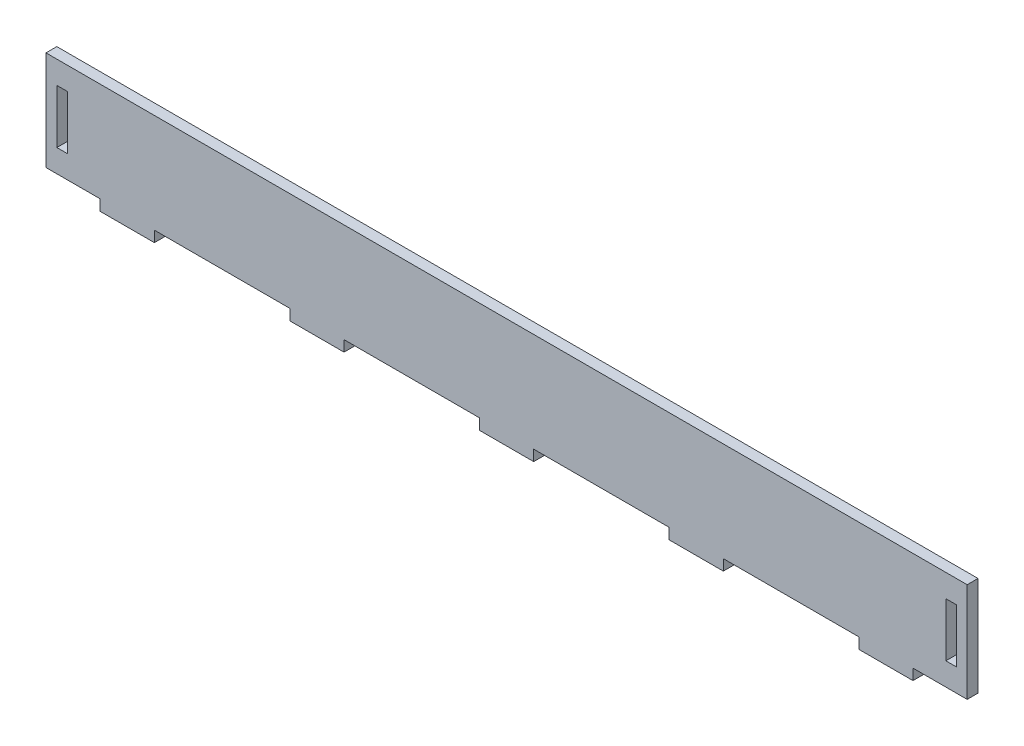
ISO-10303-21;
HEADER;
FILE_DESCRIPTION(('STEP AP214'),'2;1');
FILE_NAME('part.step','',(''),(''),'','','');
FILE_SCHEMA(('AUTOMOTIVE_DESIGN { 1 0 10303 214 1 1 1 1 }'));
ENDSEC;
DATA;
#1=APPLICATION_CONTEXT('core data for automotive mechanical design processes');
#2=APPLICATION_PROTOCOL_DEFINITION('international standard','automotive_design',2000,#1);
#3=PRODUCT_CONTEXT('',#1,'mechanical');
#4=PRODUCT('Part','Part','',(#3));
#5=PRODUCT_RELATED_PRODUCT_CATEGORY('part','',(#4));
#6=PRODUCT_DEFINITION_FORMATION('','',#4);
#7=PRODUCT_DEFINITION_CONTEXT('part definition',#1,'design');
#8=PRODUCT_DEFINITION('design','',#6,#7);
#9=PRODUCT_DEFINITION_SHAPE('','',#8);
#10=(LENGTH_UNIT() NAMED_UNIT(*) SI_UNIT(.MILLI.,.METRE.));
#11=(NAMED_UNIT(*) PLANE_ANGLE_UNIT() SI_UNIT($,.RADIAN.));
#12=(NAMED_UNIT(*) SI_UNIT($,.STERADIAN.) SOLID_ANGLE_UNIT());
#13=UNCERTAINTY_MEASURE_WITH_UNIT(LENGTH_MEASURE(1.E-05),#10,'distance_accuracy_value','');
#14=(GEOMETRIC_REPRESENTATION_CONTEXT(3) GLOBAL_UNCERTAINTY_ASSIGNED_CONTEXT((#13)) GLOBAL_UNIT_ASSIGNED_CONTEXT((#10,
#11,#12)) REPRESENTATION_CONTEXT('',''));
#15=CARTESIAN_POINT('',(0.,0.,0.));
#16=DIRECTION('',(0.,0.,1.));
#17=DIRECTION('',(1.,0.,0.));
#18=AXIS2_PLACEMENT_3D('',#15,#16,#17);
#19=CARTESIAN_POINT('',(-255.,-27.5,6.));
#20=DIRECTION('',(0.,1.,0.));
#21=DIRECTION('',(0.,0.,1.));
#22=AXIS2_PLACEMENT_3D('',#19,#20,#21);
#23=PLANE('',#22);
#24=DIRECTION('',(0.,0.,1.));
#25=VECTOR('',#24,1.);
#26=CARTESIAN_POINT('',(-195.,-27.5,6.));
#27=LINE('',#26,#25);
#28=CARTESIAN_POINT('',(-195.,-27.5,0.));
#29=VERTEX_POINT('',#28);
#30=CARTESIAN_POINT('',(-195.,-27.5,6.));
#31=VERTEX_POINT('',#30);
#32=EDGE_CURVE('E266',#29,#31,#27,.T.);
#33=ORIENTED_EDGE('',*,*,#32,.F.);
#34=DIRECTION('',(1.,0.,0.));
#35=VECTOR('',#34,1.);
#36=CARTESIAN_POINT('',(-255.,-27.5,0.));
#37=LINE('',#36,#35);
#38=CARTESIAN_POINT('',(-120.,-27.5,0.));
#39=VERTEX_POINT('',#38);
#40=EDGE_CURVE('E465',#29,#39,#37,.T.);
#41=ORIENTED_EDGE('',*,*,#40,.T.);
#42=DIRECTION('',(0.,0.,-1.));
#43=VECTOR('',#42,1.);
#44=CARTESIAN_POINT('',(-120.,-27.5,6.));
#45=LINE('',#44,#43);
#46=CARTESIAN_POINT('',(-120.,-27.5,6.));
#47=VERTEX_POINT('',#46);
#48=EDGE_CURVE('E270',#47,#39,#45,.T.);
#49=ORIENTED_EDGE('',*,*,#48,.F.);
#50=DIRECTION('',(1.,0.,0.));
#51=VECTOR('',#50,1.);
#52=CARTESIAN_POINT('',(-255.,-27.5,6.));
#53=LINE('',#52,#51);
#54=EDGE_CURVE('E48',#31,#47,#53,.T.);
#55=ORIENTED_EDGE('',*,*,#54,.F.);
#56=EDGE_LOOP('',(#33,#41,#49,#55));
#57=FACE_BOUND('',#56,.T.);
#58=ADVANCED_FACE('F33',(#57),#23,.F.);
#59=DIRECTION('',(0.,0.,-1.));
#60=VECTOR('',#59,1.);
#61=CARTESIAN_POINT('',(-225.,-27.5,5.99999999999999));
#62=LINE('',#61,#60);
#63=CARTESIAN_POINT('',(-225.,-27.5,6.));
#64=VERTEX_POINT('',#63);
#65=CARTESIAN_POINT('',(-225.,-27.5,0.));
#66=VERTEX_POINT('',#65);
#67=EDGE_CURVE('E56',#64,#66,#62,.T.);
#68=ORIENTED_EDGE('',*,*,#67,.F.);
#69=CARTESIAN_POINT('',(-255.,-27.5,6.));
#70=VERTEX_POINT('',#69);
#71=EDGE_CURVE('E453',#70,#64,#53,.T.);
#72=ORIENTED_EDGE('',*,*,#71,.F.);
#73=DIRECTION('',(0.,0.,-1.));
#74=VECTOR('',#73,1.);
#75=CARTESIAN_POINT('',(-255.,-27.5,6.));
#76=LINE('',#75,#74);
#77=CARTESIAN_POINT('',(-255.,-27.5,0.));
#78=VERTEX_POINT('',#77);
#79=EDGE_CURVE('E469',#70,#78,#76,.T.);
#80=ORIENTED_EDGE('',*,*,#79,.T.);
#81=EDGE_CURVE('E448',#78,#66,#37,.T.);
#82=ORIENTED_EDGE('',*,*,#81,.T.);
#83=EDGE_LOOP('',(#68,#72,#80,#82));
#84=FACE_BOUND('',#83,.T.);
#85=ADVANCED_FACE('F485',(#84),#23,.F.);
#86=DIRECTION('',(0.,0.,1.));
#87=VECTOR('',#86,1.);
#88=CARTESIAN_POINT('',(-90.,-27.5,6.));
#89=LINE('',#88,#87);
#90=CARTESIAN_POINT('',(-90.,-27.5,0.));
#91=VERTEX_POINT('',#90);
#92=CARTESIAN_POINT('',(-90.,-27.5,6.));
#93=VERTEX_POINT('',#92);
#94=EDGE_CURVE('E267',#91,#93,#89,.T.);
#95=ORIENTED_EDGE('',*,*,#94,.F.);
#96=CARTESIAN_POINT('',(-15.,-27.5,0.));
#97=VERTEX_POINT('',#96);
#98=EDGE_CURVE('E496',#91,#97,#37,.T.);
#99=ORIENTED_EDGE('',*,*,#98,.T.);
#100=DIRECTION('',(0.,0.,-1.));
#101=VECTOR('',#100,1.);
#102=CARTESIAN_POINT('',(-15.,-27.5,6.));
#103=LINE('',#102,#101);
#104=CARTESIAN_POINT('',(-15.,-27.5,6.));
#105=VERTEX_POINT('',#104);
#106=EDGE_CURVE('E353',#105,#97,#103,.T.);
#107=ORIENTED_EDGE('',*,*,#106,.F.);
#108=EDGE_CURVE('E533',#93,#105,#53,.T.);
#109=ORIENTED_EDGE('',*,*,#108,.F.);
#110=EDGE_LOOP('',(#95,#99,#107,#109));
#111=FACE_BOUND('',#110,.T.);
#112=ADVANCED_FACE('F499',(#111),#23,.F.);
#113=DIRECTION('',(0.,0.,-1.));
#114=VECTOR('',#113,1.);
#115=CARTESIAN_POINT('',(195.,-27.5,6.));
#116=LINE('',#115,#114);
#117=CARTESIAN_POINT('',(195.,-27.5,6.));
#118=VERTEX_POINT('',#117);
#119=CARTESIAN_POINT('',(195.,-27.5,0.));
#120=VERTEX_POINT('',#119);
#121=EDGE_CURVE('E299',#118,#120,#116,.T.);
#122=ORIENTED_EDGE('',*,*,#121,.F.);
#123=CARTESIAN_POINT('',(120.,-27.5,6.));
#124=VERTEX_POINT('',#123);
#125=EDGE_CURVE('E534',#124,#118,#53,.T.);
#126=ORIENTED_EDGE('',*,*,#125,.F.);
#127=DIRECTION('',(0.,0.,1.));
#128=VECTOR('',#127,1.);
#129=CARTESIAN_POINT('',(120.,-27.5,6.00000000000001));
#130=LINE('',#129,#128);
#131=CARTESIAN_POINT('',(120.,-27.5,0.));
#132=VERTEX_POINT('',#131);
#133=EDGE_CURVE('E331',#132,#124,#130,.T.);
#134=ORIENTED_EDGE('',*,*,#133,.F.);
#135=EDGE_CURVE('E546',#132,#120,#37,.T.);
#136=ORIENTED_EDGE('',*,*,#135,.T.);
#137=EDGE_LOOP('',(#122,#126,#134,#136));
#138=FACE_BOUND('',#137,.T.);
#139=ADVANCED_FACE('F503',(#138),#23,.F.);
#140=DIRECTION('',(0.,0.,1.));
#141=VECTOR('',#140,1.);
#142=CARTESIAN_POINT('',(225.,-27.5,6.));
#143=LINE('',#142,#141);
#144=CARTESIAN_POINT('',(225.,-27.5,0.));
#145=VERTEX_POINT('',#144);
#146=CARTESIAN_POINT('',(225.,-27.5,6.));
#147=VERTEX_POINT('',#146);
#148=EDGE_CURVE('E304',#145,#147,#143,.T.);
#149=ORIENTED_EDGE('',*,*,#148,.F.);
#150=CARTESIAN_POINT('',(255.,-27.5,0.));
#151=VERTEX_POINT('',#150);
#152=EDGE_CURVE('E463',#145,#151,#37,.T.);
#153=ORIENTED_EDGE('',*,*,#152,.T.);
#154=DIRECTION('',(0.,0.,-1.));
#155=VECTOR('',#154,1.);
#156=CARTESIAN_POINT('',(255.,-27.5,6.));
#157=LINE('',#156,#155);
#158=CARTESIAN_POINT('',(255.,-27.5,6.));
#159=VERTEX_POINT('',#158);
#160=EDGE_CURVE('E455',#159,#151,#157,.T.);
#161=ORIENTED_EDGE('',*,*,#160,.F.);
#162=EDGE_CURVE('E452',#147,#159,#53,.T.);
#163=ORIENTED_EDGE('',*,*,#162,.F.);
#164=EDGE_LOOP('',(#149,#153,#161,#163));
#165=FACE_BOUND('',#164,.T.);
#166=ADVANCED_FACE('F512',(#165),#23,.F.);
#167=DIRECTION('',(0.,0.,-1.));
#168=VECTOR('',#167,1.);
#169=CARTESIAN_POINT('',(90.,-27.5,6.));
#170=LINE('',#169,#168);
#171=CARTESIAN_POINT('',(90.,-27.5,6.));
#172=VERTEX_POINT('',#171);
#173=CARTESIAN_POINT('',(90.,-27.5,0.));
#174=VERTEX_POINT('',#173);
#175=EDGE_CURVE('E326',#172,#174,#170,.T.);
#176=ORIENTED_EDGE('',*,*,#175,.F.);
#177=CARTESIAN_POINT('',(15.,-27.5,6.));
#178=VERTEX_POINT('',#177);
#179=EDGE_CURVE('E456',#178,#172,#53,.T.);
#180=ORIENTED_EDGE('',*,*,#179,.F.);
#181=DIRECTION('',(0.,0.,1.));
#182=VECTOR('',#181,1.);
#183=CARTESIAN_POINT('',(15.,-27.5,6.));
#184=LINE('',#183,#182);
#185=CARTESIAN_POINT('',(15.,-27.5,0.));
#186=VERTEX_POINT('',#185);
#187=EDGE_CURVE('E358',#186,#178,#184,.T.);
#188=ORIENTED_EDGE('',*,*,#187,.F.);
#189=EDGE_CURVE('E466',#186,#174,#37,.T.);
#190=ORIENTED_EDGE('',*,*,#189,.T.);
#191=EDGE_LOOP('',(#176,#180,#188,#190));
#192=FACE_BOUND('',#191,.T.);
#193=ADVANCED_FACE('F508',(#192),#23,.F.);
#194=CARTESIAN_POINT('',(255.,-27.5,6.));
#195=DIRECTION('',(-1.,0.,0.));
#196=DIRECTION('',(0.,0.,1.));
#197=AXIS2_PLACEMENT_3D('',#194,#195,#196);
#198=PLANE('',#197);
#199=DIRECTION('',(0.,1.,0.));
#200=VECTOR('',#199,1.);
#201=CARTESIAN_POINT('',(255.,-27.5,0.));
#202=LINE('',#201,#200);
#203=CARTESIAN_POINT('',(255.,27.5,0.));
#204=VERTEX_POINT('',#203);
#205=EDGE_CURVE('E444',#151,#204,#202,.T.);
#206=ORIENTED_EDGE('',*,*,#205,.T.);
#207=DIRECTION('',(0.,0.,-1.));
#208=VECTOR('',#207,1.);
#209=CARTESIAN_POINT('',(255.,27.5,6.));
#210=LINE('',#209,#208);
#211=CARTESIAN_POINT('',(255.,27.5,6.));
#212=VERTEX_POINT('',#211);
#213=EDGE_CURVE('E11',#212,#204,#210,.T.);
#214=ORIENTED_EDGE('',*,*,#213,.F.);
#215=DIRECTION('',(0.,1.,0.));
#216=VECTOR('',#215,1.);
#217=CARTESIAN_POINT('',(255.,-27.5,6.));
#218=LINE('',#217,#216);
#219=EDGE_CURVE('E445',#159,#212,#218,.T.);
#220=ORIENTED_EDGE('',*,*,#219,.F.);
#221=ORIENTED_EDGE('',*,*,#160,.T.);
#222=EDGE_LOOP('',(#206,#214,#220,#221));
#223=FACE_BOUND('',#222,.T.);
#224=ADVANCED_FACE('F35',(#223),#198,.F.);
#225=CARTESIAN_POINT('',(-255.,27.5,6.));
#226=DIRECTION('',(0.,-1.,0.));
#227=DIRECTION('',(0.,0.,-1.));
#228=AXIS2_PLACEMENT_3D('',#225,#226,#227);
#229=PLANE('',#228);
#230=DIRECTION('',(-1.,0.,0.));
#231=VECTOR('',#230,1.);
#232=CARTESIAN_POINT('',(-255.,27.5,0.));
#233=LINE('',#232,#231);
#234=CARTESIAN_POINT('',(-255.,27.5,0.));
#235=VERTEX_POINT('',#234);
#236=EDGE_CURVE('E459',#204,#235,#233,.T.);
#237=ORIENTED_EDGE('',*,*,#236,.T.);
#238=DIRECTION('',(0.,0.,-1.));
#239=VECTOR('',#238,1.);
#240=CARTESIAN_POINT('',(-255.,27.5,6.));
#241=LINE('',#240,#239);
#242=CARTESIAN_POINT('',(-255.,27.5,6.));
#243=VERTEX_POINT('',#242);
#244=EDGE_CURVE('E41',#243,#235,#241,.T.);
#245=ORIENTED_EDGE('',*,*,#244,.F.);
#246=DIRECTION('',(-1.,0.,0.));
#247=VECTOR('',#246,1.);
#248=CARTESIAN_POINT('',(-255.,27.5,6.));
#249=LINE('',#248,#247);
#250=EDGE_CURVE('E447',#212,#243,#249,.T.);
#251=ORIENTED_EDGE('',*,*,#250,.F.);
#252=ORIENTED_EDGE('',*,*,#213,.T.);
#253=EDGE_LOOP('',(#237,#245,#251,#252));
#254=FACE_BOUND('',#253,.T.);
#255=ADVANCED_FACE('F521',(#254),#229,.F.);
#256=CARTESIAN_POINT('',(-255.,-27.5,6.));
#257=DIRECTION('',(1.,0.,0.));
#258=DIRECTION('',(0.,0.,-1.));
#259=AXIS2_PLACEMENT_3D('',#256,#257,#258);
#260=PLANE('',#259);
#261=DIRECTION('',(0.,-1.,0.));
#262=VECTOR('',#261,1.);
#263=CARTESIAN_POINT('',(-255.,-27.5,0.));
#264=LINE('',#263,#262);
#265=EDGE_CURVE('E461',#235,#78,#264,.T.);
#266=ORIENTED_EDGE('',*,*,#265,.T.);
#267=ORIENTED_EDGE('',*,*,#79,.F.);
#268=DIRECTION('',(0.,-1.,0.));
#269=VECTOR('',#268,1.);
#270=CARTESIAN_POINT('',(-255.,-27.5,6.));
#271=LINE('',#270,#269);
#272=EDGE_CURVE('E450',#243,#70,#271,.T.);
#273=ORIENTED_EDGE('',*,*,#272,.F.);
#274=ORIENTED_EDGE('',*,*,#244,.T.);
#275=EDGE_LOOP('',(#266,#267,#273,#274));
#276=FACE_BOUND('',#275,.T.);
#277=ADVANCED_FACE('F476',(#276),#260,.F.);
#278=CARTESIAN_POINT('',(0.,0.,6.));
#279=DIRECTION('',(0.,0.,-1.));
#280=DIRECTION('',(-1.,0.,0.));
#281=AXIS2_PLACEMENT_3D('',#278,#279,#280);
#282=PLANE('',#281);
#283=DIRECTION('',(1.,0.,0.));
#284=VECTOR('',#283,1.);
#285=CARTESIAN_POINT('',(249.,-14.9,6.));
#286=LINE('',#285,#284);
#287=CARTESIAN_POINT('',(243.2,-14.9,6.));
#288=VERTEX_POINT('',#287);
#289=CARTESIAN_POINT('',(249.,-14.9,6.));
#290=VERTEX_POINT('',#289);
#291=EDGE_CURVE('E391',#288,#290,#286,.T.);
#292=ORIENTED_EDGE('',*,*,#291,.F.);
#293=DIRECTION('',(0.,-1.,0.));
#294=VECTOR('',#293,1.);
#295=CARTESIAN_POINT('',(243.2,-14.9,6.));
#296=LINE('',#295,#294);
#297=CARTESIAN_POINT('',(243.2,14.9,6.));
#298=VERTEX_POINT('',#297);
#299=EDGE_CURVE('E389',#298,#288,#296,.T.);
#300=ORIENTED_EDGE('',*,*,#299,.F.);
#301=DIRECTION('',(-1.,0.,0.));
#302=VECTOR('',#301,1.);
#303=CARTESIAN_POINT('',(249.,14.9,6.));
#304=LINE('',#303,#302);
#305=CARTESIAN_POINT('',(249.,14.9,6.));
#306=VERTEX_POINT('',#305);
#307=EDGE_CURVE('E397',#306,#298,#304,.T.);
#308=ORIENTED_EDGE('',*,*,#307,.F.);
#309=DIRECTION('',(0.,1.,0.));
#310=VECTOR('',#309,1.);
#311=CARTESIAN_POINT('',(249.,-14.9,6.));
#312=LINE('',#311,#310);
#313=EDGE_CURVE('E394',#290,#306,#312,.T.);
#314=ORIENTED_EDGE('',*,*,#313,.F.);
#315=EDGE_LOOP('',(#292,#300,#308,#314));
#316=FACE_BOUND('',#315,.T.);
#317=DIRECTION('',(1.,0.,0.));
#318=VECTOR('',#317,1.);
#319=CARTESIAN_POINT('',(-243.2,-14.9,6.));
#320=LINE('',#319,#318);
#321=CARTESIAN_POINT('',(-249.,-14.9,6.));
#322=VERTEX_POINT('',#321);
#323=CARTESIAN_POINT('',(-243.2,-14.9,6.));
#324=VERTEX_POINT('',#323);
#325=EDGE_CURVE('E423',#322,#324,#320,.T.);
#326=ORIENTED_EDGE('',*,*,#325,.F.);
#327=DIRECTION('',(0.,-1.,0.));
#328=VECTOR('',#327,1.);
#329=CARTESIAN_POINT('',(-249.,-14.9,6.));
#330=LINE('',#329,#328);
#331=CARTESIAN_POINT('',(-249.,14.9,6.));
#332=VERTEX_POINT('',#331);
#333=EDGE_CURVE('E421',#332,#322,#330,.T.);
#334=ORIENTED_EDGE('',*,*,#333,.F.);
#335=DIRECTION('',(-1.,0.,0.));
#336=VECTOR('',#335,1.);
#337=CARTESIAN_POINT('',(-243.2,14.9,6.));
#338=LINE('',#337,#336);
#339=CARTESIAN_POINT('',(-243.2,14.9,6.));
#340=VERTEX_POINT('',#339);
#341=EDGE_CURVE('E429',#340,#332,#338,.T.);
#342=ORIENTED_EDGE('',*,*,#341,.F.);
#343=DIRECTION('',(0.,1.,0.));
#344=VECTOR('',#343,1.);
#345=CARTESIAN_POINT('',(-243.2,-14.9,6.));
#346=LINE('',#345,#344);
#347=EDGE_CURVE('E426',#324,#340,#346,.T.);
#348=ORIENTED_EDGE('',*,*,#347,.F.);
#349=EDGE_LOOP('',(#326,#334,#342,#348));
#350=FACE_BOUND('',#349,.T.);
#351=ORIENTED_EDGE('',*,*,#219,.T.);
#352=ORIENTED_EDGE('',*,*,#250,.T.);
#353=ORIENTED_EDGE('',*,*,#272,.T.);
#354=ORIENTED_EDGE('',*,*,#71,.T.);
#355=DIRECTION('',(0.,1.,0.));
#356=VECTOR('',#355,1.);
#357=CARTESIAN_POINT('',(-225.,-33.5,5.99999999999999));
#358=LINE('',#357,#356);
#359=CARTESIAN_POINT('',(-225.,-33.5,5.99999999999999));
#360=VERTEX_POINT('',#359);
#361=EDGE_CURVE('E251',#360,#64,#358,.T.);
#362=ORIENTED_EDGE('',*,*,#361,.F.);
#363=DIRECTION('',(-1.,0.,0.));
#364=VECTOR('',#363,1.);
#365=CARTESIAN_POINT('',(-195.,-33.5,6.));
#366=LINE('',#365,#364);
#367=CARTESIAN_POINT('',(-195.,-33.5,6.));
#368=VERTEX_POINT('',#367);
#369=EDGE_CURVE('E243',#368,#360,#366,.T.);
#370=ORIENTED_EDGE('',*,*,#369,.F.);
#371=DIRECTION('',(0.,1.,0.));
#372=VECTOR('',#371,1.);
#373=CARTESIAN_POINT('',(-195.,-33.5,6.));
#374=LINE('',#373,#372);
#375=EDGE_CURVE('E248',#368,#31,#374,.T.);
#376=ORIENTED_EDGE('',*,*,#375,.T.);
#377=ORIENTED_EDGE('',*,*,#54,.T.);
#378=DIRECTION('',(0.,1.,0.));
#379=VECTOR('',#378,1.);
#380=CARTESIAN_POINT('',(-120.,-33.5,6.));
#381=LINE('',#380,#379);
#382=CARTESIAN_POINT('',(-120.,-33.5,6.));
#383=VERTEX_POINT('',#382);
#384=EDGE_CURVE('E293',#383,#47,#381,.T.);
#385=ORIENTED_EDGE('',*,*,#384,.F.);
#386=DIRECTION('',(-1.,0.,0.));
#387=VECTOR('',#386,1.);
#388=CARTESIAN_POINT('',(-90.,-33.5,6.));
#389=LINE('',#388,#387);
#390=CARTESIAN_POINT('',(-90.,-33.5,6.));
#391=VERTEX_POINT('',#390);
#392=EDGE_CURVE('E279',#391,#383,#389,.T.);
#393=ORIENTED_EDGE('',*,*,#392,.F.);
#394=DIRECTION('',(0.,1.,0.));
#395=VECTOR('',#394,1.);
#396=CARTESIAN_POINT('',(-90.,-33.5,6.));
#397=LINE('',#396,#395);
#398=EDGE_CURVE('E296',#391,#93,#397,.T.);
#399=ORIENTED_EDGE('',*,*,#398,.T.);
#400=ORIENTED_EDGE('',*,*,#108,.T.);
#401=DIRECTION('',(0.,1.,0.));
#402=VECTOR('',#401,1.);
#403=CARTESIAN_POINT('',(-15.,-33.5,6.));
#404=LINE('',#403,#402);
#405=CARTESIAN_POINT('',(-15.,-33.5,6.));
#406=VERTEX_POINT('',#405);
#407=EDGE_CURVE('E364',#406,#105,#404,.T.);
#408=ORIENTED_EDGE('',*,*,#407,.F.);
#409=DIRECTION('',(-1.,0.,0.));
#410=VECTOR('',#409,1.);
#411=CARTESIAN_POINT('',(-15.,-33.5,6.));
#412=LINE('',#411,#410);
#413=CARTESIAN_POINT('',(15.,-33.5,6.));
#414=VERTEX_POINT('',#413);
#415=EDGE_CURVE('E362',#414,#406,#412,.T.);
#416=ORIENTED_EDGE('',*,*,#415,.F.);
#417=DIRECTION('',(0.,1.,0.));
#418=VECTOR('',#417,1.);
#419=CARTESIAN_POINT('',(15.,-33.5,6.));
#420=LINE('',#419,#418);
#421=EDGE_CURVE('E371',#414,#178,#420,.T.);
#422=ORIENTED_EDGE('',*,*,#421,.T.);
#423=ORIENTED_EDGE('',*,*,#179,.T.);
#424=DIRECTION('',(0.,1.,0.));
#425=VECTOR('',#424,1.);
#426=CARTESIAN_POINT('',(90.,-33.5,6.));
#427=LINE('',#426,#425);
#428=CARTESIAN_POINT('',(90.,-33.5,6.));
#429=VERTEX_POINT('',#428);
#430=EDGE_CURVE('E337',#429,#172,#427,.T.);
#431=ORIENTED_EDGE('',*,*,#430,.F.);
#432=DIRECTION('',(-1.,0.,0.));
#433=VECTOR('',#432,1.);
#434=CARTESIAN_POINT('',(90.,-33.5,6.));
#435=LINE('',#434,#433);
#436=CARTESIAN_POINT('',(120.,-33.5,6.00000000000001));
#437=VERTEX_POINT('',#436);
#438=EDGE_CURVE('E335',#437,#429,#435,.T.);
#439=ORIENTED_EDGE('',*,*,#438,.F.);
#440=DIRECTION('',(0.,1.,0.));
#441=VECTOR('',#440,1.);
#442=CARTESIAN_POINT('',(120.,-33.5,6.00000000000001));
#443=LINE('',#442,#441);
#444=EDGE_CURVE('E344',#437,#124,#443,.T.);
#445=ORIENTED_EDGE('',*,*,#444,.T.);
#446=ORIENTED_EDGE('',*,*,#125,.T.);
#447=DIRECTION('',(0.,1.,0.));
#448=VECTOR('',#447,1.);
#449=CARTESIAN_POINT('',(195.,-33.5,6.));
#450=LINE('',#449,#448);
#451=CARTESIAN_POINT('',(195.,-33.5,6.));
#452=VERTEX_POINT('',#451);
#453=EDGE_CURVE('E310',#452,#118,#450,.T.);
#454=ORIENTED_EDGE('',*,*,#453,.F.);
#455=DIRECTION('',(-1.,0.,0.));
#456=VECTOR('',#455,1.);
#457=CARTESIAN_POINT('',(195.,-33.5,6.));
#458=LINE('',#457,#456);
#459=CARTESIAN_POINT('',(225.,-33.5,6.));
#460=VERTEX_POINT('',#459);
#461=EDGE_CURVE('E308',#460,#452,#458,.T.);
#462=ORIENTED_EDGE('',*,*,#461,.F.);
#463=DIRECTION('',(0.,1.,0.));
#464=VECTOR('',#463,1.);
#465=CARTESIAN_POINT('',(225.,-33.5,6.));
#466=LINE('',#465,#464);
#467=EDGE_CURVE('E317',#460,#147,#466,.T.);
#468=ORIENTED_EDGE('',*,*,#467,.T.);
#469=ORIENTED_EDGE('',*,*,#162,.T.);
#470=EDGE_LOOP('',(#351,#352,#353,#354,#362,#370,#376,#377,#385,#393,#399,#400,#408,#416,#422,
#423,#431,#439,#445,#446,#454,#462,#468,#469));
#471=FACE_BOUND('',#470,.T.);
#472=ADVANCED_FACE('F246',(#316,#350,#471),#282,.F.);
#473=CARTESIAN_POINT('',(0.,0.,0.));
#474=DIRECTION('',(0.,0.,-1.));
#475=DIRECTION('',(-1.,0.,0.));
#476=AXIS2_PLACEMENT_3D('',#473,#474,#475);
#477=PLANE('',#476);
#478=DIRECTION('',(0.,-1.,0.));
#479=VECTOR('',#478,1.);
#480=CARTESIAN_POINT('',(243.2,-14.9,0.));
#481=LINE('',#480,#479);
#482=CARTESIAN_POINT('',(243.2,14.9,0.));
#483=VERTEX_POINT('',#482);
#484=CARTESIAN_POINT('',(243.2,-14.9,0.));
#485=VERTEX_POINT('',#484);
#486=EDGE_CURVE('E386',#483,#485,#481,.T.);
#487=ORIENTED_EDGE('',*,*,#486,.T.);
#488=DIRECTION('',(1.,0.,0.));
#489=VECTOR('',#488,1.);
#490=CARTESIAN_POINT('',(249.,-14.9,0.));
#491=LINE('',#490,#489);
#492=CARTESIAN_POINT('',(249.,-14.9,0.));
#493=VERTEX_POINT('',#492);
#494=EDGE_CURVE('E403',#485,#493,#491,.T.);
#495=ORIENTED_EDGE('',*,*,#494,.T.);
#496=DIRECTION('',(0.,1.,0.));
#497=VECTOR('',#496,1.);
#498=CARTESIAN_POINT('',(249.,-14.9,0.));
#499=LINE('',#498,#497);
#500=CARTESIAN_POINT('',(249.,14.9,0.));
#501=VERTEX_POINT('',#500);
#502=EDGE_CURVE('E380',#493,#501,#499,.T.);
#503=ORIENTED_EDGE('',*,*,#502,.T.);
#504=DIRECTION('',(-1.,0.,0.));
#505=VECTOR('',#504,1.);
#506=CARTESIAN_POINT('',(249.,14.9,0.));
#507=LINE('',#506,#505);
#508=EDGE_CURVE('E383',#501,#483,#507,.T.);
#509=ORIENTED_EDGE('',*,*,#508,.T.);
#510=EDGE_LOOP('',(#487,#495,#503,#509));
#511=FACE_BOUND('',#510,.T.);
#512=DIRECTION('',(0.,-1.,0.));
#513=VECTOR('',#512,1.);
#514=CARTESIAN_POINT('',(-249.,-14.9,0.));
#515=LINE('',#514,#513);
#516=CARTESIAN_POINT('',(-249.,14.9,0.));
#517=VERTEX_POINT('',#516);
#518=CARTESIAN_POINT('',(-249.,-14.9,0.));
#519=VERTEX_POINT('',#518);
#520=EDGE_CURVE('E418',#517,#519,#515,.T.);
#521=ORIENTED_EDGE('',*,*,#520,.T.);
#522=DIRECTION('',(1.,0.,0.));
#523=VECTOR('',#522,1.);
#524=CARTESIAN_POINT('',(-243.2,-14.9,0.));
#525=LINE('',#524,#523);
#526=CARTESIAN_POINT('',(-243.2,-14.9,0.));
#527=VERTEX_POINT('',#526);
#528=EDGE_CURVE('E435',#519,#527,#525,.T.);
#529=ORIENTED_EDGE('',*,*,#528,.T.);
#530=DIRECTION('',(0.,1.,0.));
#531=VECTOR('',#530,1.);
#532=CARTESIAN_POINT('',(-243.2,-14.9,0.));
#533=LINE('',#532,#531);
#534=CARTESIAN_POINT('',(-243.2,14.9,0.));
#535=VERTEX_POINT('',#534);
#536=EDGE_CURVE('E412',#527,#535,#533,.T.);
#537=ORIENTED_EDGE('',*,*,#536,.T.);
#538=DIRECTION('',(-1.,0.,0.));
#539=VECTOR('',#538,1.);
#540=CARTESIAN_POINT('',(-243.2,14.9,0.));
#541=LINE('',#540,#539);
#542=EDGE_CURVE('E415',#535,#517,#541,.T.);
#543=ORIENTED_EDGE('',*,*,#542,.T.);
#544=EDGE_LOOP('',(#521,#529,#537,#543));
#545=FACE_BOUND('',#544,.T.);
#546=ORIENTED_EDGE('',*,*,#205,.F.);
#547=ORIENTED_EDGE('',*,*,#152,.F.);
#548=DIRECTION('',(0.,1.,0.));
#549=VECTOR('',#548,1.);
#550=CARTESIAN_POINT('',(225.,-33.5,0.));
#551=LINE('',#550,#549);
#552=CARTESIAN_POINT('',(225.,-33.5,0.));
#553=VERTEX_POINT('',#552);
#554=EDGE_CURVE('E320',#553,#145,#551,.T.);
#555=ORIENTED_EDGE('',*,*,#554,.F.);
#556=DIRECTION('',(1.,0.,0.));
#557=VECTOR('',#556,1.);
#558=CARTESIAN_POINT('',(195.,-33.5,0.));
#559=LINE('',#558,#557);
#560=CARTESIAN_POINT('',(195.,-33.5,0.));
#561=VERTEX_POINT('',#560);
#562=EDGE_CURVE('E303',#561,#553,#559,.T.);
#563=ORIENTED_EDGE('',*,*,#562,.F.);
#564=DIRECTION('',(0.,1.,0.));
#565=VECTOR('',#564,1.);
#566=CARTESIAN_POINT('',(195.,-33.5,0.));
#567=LINE('',#566,#565);
#568=EDGE_CURVE('E323',#561,#120,#567,.T.);
#569=ORIENTED_EDGE('',*,*,#568,.T.);
#570=ORIENTED_EDGE('',*,*,#135,.F.);
#571=DIRECTION('',(0.,1.,0.));
#572=VECTOR('',#571,1.);
#573=CARTESIAN_POINT('',(120.,-33.5,0.));
#574=LINE('',#573,#572);
#575=CARTESIAN_POINT('',(120.,-33.5,0.));
#576=VERTEX_POINT('',#575);
#577=EDGE_CURVE('E347',#576,#132,#574,.T.);
#578=ORIENTED_EDGE('',*,*,#577,.F.);
#579=DIRECTION('',(1.,0.,0.));
#580=VECTOR('',#579,1.);
#581=CARTESIAN_POINT('',(90.,-33.5,0.));
#582=LINE('',#581,#580);
#583=CARTESIAN_POINT('',(90.,-33.5,0.));
#584=VERTEX_POINT('',#583);
#585=EDGE_CURVE('E330',#584,#576,#582,.T.);
#586=ORIENTED_EDGE('',*,*,#585,.F.);
#587=DIRECTION('',(0.,1.,0.));
#588=VECTOR('',#587,1.);
#589=CARTESIAN_POINT('',(90.,-33.5,0.));
#590=LINE('',#589,#588);
#591=EDGE_CURVE('E350',#584,#174,#590,.T.);
#592=ORIENTED_EDGE('',*,*,#591,.T.);
#593=ORIENTED_EDGE('',*,*,#189,.F.);
#594=DIRECTION('',(0.,1.,0.));
#595=VECTOR('',#594,1.);
#596=CARTESIAN_POINT('',(15.,-33.5,0.));
#597=LINE('',#596,#595);
#598=CARTESIAN_POINT('',(15.,-33.5,0.));
#599=VERTEX_POINT('',#598);
#600=EDGE_CURVE('E374',#599,#186,#597,.T.);
#601=ORIENTED_EDGE('',*,*,#600,.F.);
#602=DIRECTION('',(1.,0.,0.));
#603=VECTOR('',#602,1.);
#604=CARTESIAN_POINT('',(-15.,-33.5,0.));
#605=LINE('',#604,#603);
#606=CARTESIAN_POINT('',(-15.,-33.5,0.));
#607=VERTEX_POINT('',#606);
#608=EDGE_CURVE('E357',#607,#599,#605,.T.);
#609=ORIENTED_EDGE('',*,*,#608,.F.);
#610=DIRECTION('',(0.,1.,0.));
#611=VECTOR('',#610,1.);
#612=CARTESIAN_POINT('',(-15.,-33.5,0.));
#613=LINE('',#612,#611);
#614=EDGE_CURVE('E377',#607,#97,#613,.T.);
#615=ORIENTED_EDGE('',*,*,#614,.T.);
#616=ORIENTED_EDGE('',*,*,#98,.F.);
#617=DIRECTION('',(0.,1.,0.));
#618=VECTOR('',#617,1.);
#619=CARTESIAN_POINT('',(-90.,-33.5,0.));
#620=LINE('',#619,#618);
#621=CARTESIAN_POINT('',(-90.,-33.5,0.));
#622=VERTEX_POINT('',#621);
#623=EDGE_CURVE('E284',#622,#91,#620,.T.);
#624=ORIENTED_EDGE('',*,*,#623,.F.);
#625=DIRECTION('',(1.,0.,0.));
#626=VECTOR('',#625,1.);
#627=CARTESIAN_POINT('',(-90.,-33.5,0.));
#628=LINE('',#627,#626);
#629=CARTESIAN_POINT('',(-120.,-33.5,0.));
#630=VERTEX_POINT('',#629);
#631=EDGE_CURVE('E283',#630,#622,#628,.T.);
#632=ORIENTED_EDGE('',*,*,#631,.F.);
#633=DIRECTION('',(0.,1.,0.));
#634=VECTOR('',#633,1.);
#635=CARTESIAN_POINT('',(-120.,-33.5,0.));
#636=LINE('',#635,#634);
#637=EDGE_CURVE('E290',#630,#39,#636,.T.);
#638=ORIENTED_EDGE('',*,*,#637,.T.);
#639=ORIENTED_EDGE('',*,*,#40,.F.);
#640=DIRECTION('',(0.,1.,0.));
#641=VECTOR('',#640,1.);
#642=CARTESIAN_POINT('',(-195.,-33.5,0.));
#643=LINE('',#642,#641);
#644=CARTESIAN_POINT('',(-195.,-33.5,0.));
#645=VERTEX_POINT('',#644);
#646=EDGE_CURVE('E492',#645,#29,#643,.T.);
#647=ORIENTED_EDGE('',*,*,#646,.F.);
#648=DIRECTION('',(1.,0.,0.));
#649=VECTOR('',#648,1.);
#650=CARTESIAN_POINT('',(-195.,-33.5,0.));
#651=LINE('',#650,#649);
#652=CARTESIAN_POINT('',(-225.,-33.5,0.));
#653=VERTEX_POINT('',#652);
#654=EDGE_CURVE('E260',#653,#645,#651,.T.);
#655=ORIENTED_EDGE('',*,*,#654,.F.);
#656=DIRECTION('',(0.,1.,0.));
#657=VECTOR('',#656,1.);
#658=CARTESIAN_POINT('',(-225.,-33.5,0.));
#659=LINE('',#658,#657);
#660=EDGE_CURVE('E272',#653,#66,#659,.T.);
#661=ORIENTED_EDGE('',*,*,#660,.T.);
#662=ORIENTED_EDGE('',*,*,#81,.F.);
#663=ORIENTED_EDGE('',*,*,#265,.F.);
#664=ORIENTED_EDGE('',*,*,#236,.F.);
#665=EDGE_LOOP('',(#546,#547,#555,#563,#569,#570,#578,#586,#592,#593,#601,#609,#615,#616,#624,
#632,#638,#639,#647,#655,#661,#662,#663,#664));
#666=FACE_BOUND('',#665,.T.);
#667=ADVANCED_FACE('F482',(#511,#545,#666),#477,.T.);
#668=CARTESIAN_POINT('',(-249.,-14.9,-0.00100000000000013));
#669=DIRECTION('',(-1.,0.,0.));
#670=DIRECTION('',(0.,0.,1.));
#671=AXIS2_PLACEMENT_3D('',#668,#669,#670);
#672=PLANE('',#671);
#673=DIRECTION('',(0.,0.,1.));
#674=VECTOR('',#673,1.);
#675=CARTESIAN_POINT('',(-249.,14.9,-0.00100000000000013));
#676=LINE('',#675,#674);
#677=EDGE_CURVE('E433',#517,#332,#676,.T.);
#678=ORIENTED_EDGE('',*,*,#677,.T.);
#679=ORIENTED_EDGE('',*,*,#333,.T.);
#680=DIRECTION('',(0.,0.,1.));
#681=VECTOR('',#680,1.);
#682=CARTESIAN_POINT('',(-249.,-14.9,-0.00100000000000013));
#683=LINE('',#682,#681);
#684=EDGE_CURVE('E432',#519,#322,#683,.T.);
#685=ORIENTED_EDGE('',*,*,#684,.F.);
#686=ORIENTED_EDGE('',*,*,#520,.F.);
#687=EDGE_LOOP('',(#678,#679,#685,#686));
#688=FACE_BOUND('',#687,.T.);
#689=ADVANCED_FACE('F587',(#688),#672,.F.);
#690=CARTESIAN_POINT('',(-243.2,14.9,-0.00100000000000013));
#691=DIRECTION('',(0.,1.,0.));
#692=DIRECTION('',(0.,0.,1.));
#693=AXIS2_PLACEMENT_3D('',#690,#691,#692);
#694=PLANE('',#693);
#695=DIRECTION('',(0.,0.,1.));
#696=VECTOR('',#695,1.);
#697=CARTESIAN_POINT('',(-243.2,14.9,-0.00100000000000013));
#698=LINE('',#697,#696);
#699=EDGE_CURVE('E436',#535,#340,#698,.T.);
#700=ORIENTED_EDGE('',*,*,#699,.T.);
#701=ORIENTED_EDGE('',*,*,#341,.T.);
#702=ORIENTED_EDGE('',*,*,#677,.F.);
#703=ORIENTED_EDGE('',*,*,#542,.F.);
#704=EDGE_LOOP('',(#700,#701,#702,#703));
#705=FACE_BOUND('',#704,.T.);
#706=ADVANCED_FACE('F594',(#705),#694,.F.);
#707=CARTESIAN_POINT('',(-243.2,-14.9,-0.00100000000000013));
#708=DIRECTION('',(1.,0.,0.));
#709=DIRECTION('',(0.,0.,-1.));
#710=AXIS2_PLACEMENT_3D('',#707,#708,#709);
#711=PLANE('',#710);
#712=DIRECTION('',(0.,0.,1.));
#713=VECTOR('',#712,1.);
#714=CARTESIAN_POINT('',(-243.2,-14.9,-0.00100000000000013));
#715=LINE('',#714,#713);
#716=EDGE_CURVE('E438',#527,#324,#715,.T.);
#717=ORIENTED_EDGE('',*,*,#716,.T.);
#718=ORIENTED_EDGE('',*,*,#347,.T.);
#719=ORIENTED_EDGE('',*,*,#699,.F.);
#720=ORIENTED_EDGE('',*,*,#536,.F.);
#721=EDGE_LOOP('',(#717,#718,#719,#720));
#722=FACE_BOUND('',#721,.T.);
#723=ADVANCED_FACE('F600',(#722),#711,.F.);
#724=CARTESIAN_POINT('',(-243.2,-14.9,-0.00100000000000013));
#725=DIRECTION('',(0.,-1.,0.));
#726=DIRECTION('',(1.,0.,0.));
#727=AXIS2_PLACEMENT_3D('',#724,#725,#726);
#728=PLANE('',#727);
#729=ORIENTED_EDGE('',*,*,#684,.T.);
#730=ORIENTED_EDGE('',*,*,#325,.T.);
#731=ORIENTED_EDGE('',*,*,#716,.F.);
#732=ORIENTED_EDGE('',*,*,#528,.F.);
#733=EDGE_LOOP('',(#729,#730,#731,#732));
#734=FACE_BOUND('',#733,.T.);
#735=ADVANCED_FACE('F596',(#734),#728,.F.);
#736=CARTESIAN_POINT('',(243.2,-14.9,-0.00100000000000013));
#737=DIRECTION('',(-1.,0.,0.));
#738=DIRECTION('',(0.,0.,1.));
#739=AXIS2_PLACEMENT_3D('',#736,#737,#738);
#740=PLANE('',#739);
#741=DIRECTION('',(0.,0.,1.));
#742=VECTOR('',#741,1.);
#743=CARTESIAN_POINT('',(243.2,14.9,-0.00100000000000013));
#744=LINE('',#743,#742);
#745=EDGE_CURVE('E401',#483,#298,#744,.T.);
#746=ORIENTED_EDGE('',*,*,#745,.T.);
#747=ORIENTED_EDGE('',*,*,#299,.T.);
#748=DIRECTION('',(0.,0.,1.));
#749=VECTOR('',#748,1.);
#750=CARTESIAN_POINT('',(243.2,-14.9,-0.00100000000000013));
#751=LINE('',#750,#749);
#752=EDGE_CURVE('E400',#485,#288,#751,.T.);
#753=ORIENTED_EDGE('',*,*,#752,.F.);
#754=ORIENTED_EDGE('',*,*,#486,.F.);
#755=EDGE_LOOP('',(#746,#747,#753,#754));
#756=FACE_BOUND('',#755,.T.);
#757=ADVANCED_FACE('F599',(#756),#740,.F.);
#758=CARTESIAN_POINT('',(249.,14.9,-0.00100000000000013));
#759=DIRECTION('',(0.,1.,0.));
#760=DIRECTION('',(0.,0.,1.));
#761=AXIS2_PLACEMENT_3D('',#758,#759,#760);
#762=PLANE('',#761);
#763=DIRECTION('',(0.,0.,1.));
#764=VECTOR('',#763,1.);
#765=CARTESIAN_POINT('',(249.,14.9,-0.00100000000000013));
#766=LINE('',#765,#764);
#767=EDGE_CURVE('E404',#501,#306,#766,.T.);
#768=ORIENTED_EDGE('',*,*,#767,.T.);
#769=ORIENTED_EDGE('',*,*,#307,.T.);
#770=ORIENTED_EDGE('',*,*,#745,.F.);
#771=ORIENTED_EDGE('',*,*,#508,.F.);
#772=EDGE_LOOP('',(#768,#769,#770,#771));
#773=FACE_BOUND('',#772,.T.);
#774=ADVANCED_FACE('F610',(#773),#762,.F.);
#775=CARTESIAN_POINT('',(249.,-14.9,-0.00100000000000013));
#776=DIRECTION('',(1.,0.,0.));
#777=DIRECTION('',(0.,0.,-1.));
#778=AXIS2_PLACEMENT_3D('',#775,#776,#777);
#779=PLANE('',#778);
#780=DIRECTION('',(0.,0.,1.));
#781=VECTOR('',#780,1.);
#782=CARTESIAN_POINT('',(249.,-14.9,-0.00100000000000013));
#783=LINE('',#782,#781);
#784=EDGE_CURVE('E406',#493,#290,#783,.T.);
#785=ORIENTED_EDGE('',*,*,#784,.T.);
#786=ORIENTED_EDGE('',*,*,#313,.T.);
#787=ORIENTED_EDGE('',*,*,#767,.F.);
#788=ORIENTED_EDGE('',*,*,#502,.F.);
#789=EDGE_LOOP('',(#785,#786,#787,#788));
#790=FACE_BOUND('',#789,.T.);
#791=ADVANCED_FACE('F615',(#790),#779,.F.);
#792=CARTESIAN_POINT('',(249.,-14.9,-0.00100000000000013));
#793=DIRECTION('',(0.,-1.,0.));
#794=DIRECTION('',(0.,0.,-1.));
#795=AXIS2_PLACEMENT_3D('',#792,#793,#794);
#796=PLANE('',#795);
#797=ORIENTED_EDGE('',*,*,#752,.T.);
#798=ORIENTED_EDGE('',*,*,#291,.T.);
#799=ORIENTED_EDGE('',*,*,#784,.F.);
#800=ORIENTED_EDGE('',*,*,#494,.F.);
#801=EDGE_LOOP('',(#797,#798,#799,#800));
#802=FACE_BOUND('',#801,.T.);
#803=ADVANCED_FACE('F612',(#802),#796,.F.);
#804=CARTESIAN_POINT('',(-15.,-33.5,6.));
#805=DIRECTION('',(1.,0.,0.));
#806=DIRECTION('',(0.,0.,-1.));
#807=AXIS2_PLACEMENT_3D('',#804,#805,#806);
#808=PLANE('',#807);
#809=ORIENTED_EDGE('',*,*,#106,.T.);
#810=ORIENTED_EDGE('',*,*,#614,.F.);
#811=DIRECTION('',(0.,0.,-1.));
#812=VECTOR('',#811,1.);
#813=CARTESIAN_POINT('',(-15.,-33.5,6.));
#814=LINE('',#813,#812);
#815=EDGE_CURVE('E354',#406,#607,#814,.T.);
#816=ORIENTED_EDGE('',*,*,#815,.F.);
#817=ORIENTED_EDGE('',*,*,#407,.T.);
#818=EDGE_LOOP('',(#809,#810,#816,#817));
#819=FACE_BOUND('',#818,.T.);
#820=ADVANCED_FACE('F564',(#819),#808,.F.);
#821=CARTESIAN_POINT('',(15.,-33.5,6.));
#822=DIRECTION('',(-1.,0.,0.));
#823=DIRECTION('',(0.,0.,1.));
#824=AXIS2_PLACEMENT_3D('',#821,#822,#823);
#825=PLANE('',#824);
#826=ORIENTED_EDGE('',*,*,#187,.T.);
#827=ORIENTED_EDGE('',*,*,#421,.F.);
#828=DIRECTION('',(0.,0.,1.));
#829=VECTOR('',#828,1.);
#830=CARTESIAN_POINT('',(15.,-33.5,6.));
#831=LINE('',#830,#829);
#832=EDGE_CURVE('E360',#599,#414,#831,.T.);
#833=ORIENTED_EDGE('',*,*,#832,.F.);
#834=ORIENTED_EDGE('',*,*,#600,.T.);
#835=EDGE_LOOP('',(#826,#827,#833,#834));
#836=FACE_BOUND('',#835,.T.);
#837=ADVANCED_FACE('F570',(#836),#825,.F.);
#838=CARTESIAN_POINT('',(0.,-33.5,0.));
#839=DIRECTION('',(0.,-1.,0.));
#840=DIRECTION('',(0.,0.,-1.));
#841=AXIS2_PLACEMENT_3D('',#838,#839,#840);
#842=PLANE('',#841);
#843=ORIENTED_EDGE('',*,*,#815,.T.);
#844=ORIENTED_EDGE('',*,*,#608,.T.);
#845=ORIENTED_EDGE('',*,*,#832,.T.);
#846=ORIENTED_EDGE('',*,*,#415,.T.);
#847=EDGE_LOOP('',(#843,#844,#845,#846));
#848=FACE_BOUND('',#847,.T.);
#849=ADVANCED_FACE('F566',(#848),#842,.T.);
#850=CARTESIAN_POINT('',(90.,-33.5,6.));
#851=DIRECTION('',(1.,0.,0.));
#852=DIRECTION('',(0.,0.,-1.));
#853=AXIS2_PLACEMENT_3D('',#850,#851,#852);
#854=PLANE('',#853);
#855=ORIENTED_EDGE('',*,*,#175,.T.);
#856=ORIENTED_EDGE('',*,*,#591,.F.);
#857=DIRECTION('',(0.,0.,-1.));
#858=VECTOR('',#857,1.);
#859=CARTESIAN_POINT('',(90.,-33.5,6.));
#860=LINE('',#859,#858);
#861=EDGE_CURVE('E327',#429,#584,#860,.T.);
#862=ORIENTED_EDGE('',*,*,#861,.F.);
#863=ORIENTED_EDGE('',*,*,#430,.T.);
#864=EDGE_LOOP('',(#855,#856,#862,#863));
#865=FACE_BOUND('',#864,.T.);
#866=ADVANCED_FACE('F535',(#865),#854,.F.);
#867=CARTESIAN_POINT('',(120.,-33.5,6.00000000000001));
#868=DIRECTION('',(-1.,0.,0.));
#869=DIRECTION('',(0.,0.,1.));
#870=AXIS2_PLACEMENT_3D('',#867,#868,#869);
#871=PLANE('',#870);
#872=ORIENTED_EDGE('',*,*,#133,.T.);
#873=ORIENTED_EDGE('',*,*,#444,.F.);
#874=DIRECTION('',(0.,0.,1.));
#875=VECTOR('',#874,1.);
#876=CARTESIAN_POINT('',(120.,-33.5,6.00000000000001));
#877=LINE('',#876,#875);
#878=EDGE_CURVE('E333',#576,#437,#877,.T.);
#879=ORIENTED_EDGE('',*,*,#878,.F.);
#880=ORIENTED_EDGE('',*,*,#577,.T.);
#881=EDGE_LOOP('',(#872,#873,#879,#880));
#882=FACE_BOUND('',#881,.T.);
#883=ADVANCED_FACE('F544',(#882),#871,.F.);
#884=CARTESIAN_POINT('',(0.,-33.5,0.));
#885=DIRECTION('',(0.,-1.,0.));
#886=DIRECTION('',(0.,0.,-1.));
#887=AXIS2_PLACEMENT_3D('',#884,#885,#886);
#888=PLANE('',#887);
#889=ORIENTED_EDGE('',*,*,#861,.T.);
#890=ORIENTED_EDGE('',*,*,#585,.T.);
#891=ORIENTED_EDGE('',*,*,#878,.T.);
#892=ORIENTED_EDGE('',*,*,#438,.T.);
#893=EDGE_LOOP('',(#889,#890,#891,#892));
#894=FACE_BOUND('',#893,.T.);
#895=ADVANCED_FACE('F537',(#894),#888,.T.);
#896=CARTESIAN_POINT('',(195.,-33.5,6.));
#897=DIRECTION('',(1.,0.,0.));
#898=DIRECTION('',(0.,0.,-1.));
#899=AXIS2_PLACEMENT_3D('',#896,#897,#898);
#900=PLANE('',#899);
#901=ORIENTED_EDGE('',*,*,#121,.T.);
#902=ORIENTED_EDGE('',*,*,#568,.F.);
#903=DIRECTION('',(0.,0.,-1.));
#904=VECTOR('',#903,1.);
#905=CARTESIAN_POINT('',(195.,-33.5,6.));
#906=LINE('',#905,#904);
#907=EDGE_CURVE('E300',#452,#561,#906,.T.);
#908=ORIENTED_EDGE('',*,*,#907,.F.);
#909=ORIENTED_EDGE('',*,*,#453,.T.);
#910=EDGE_LOOP('',(#901,#902,#908,#909));
#911=FACE_BOUND('',#910,.T.);
#912=ADVANCED_FACE('F635',(#911),#900,.F.);
#913=CARTESIAN_POINT('',(225.,-33.5,6.));
#914=DIRECTION('',(-1.,0.,0.));
#915=DIRECTION('',(0.,0.,1.));
#916=AXIS2_PLACEMENT_3D('',#913,#914,#915);
#917=PLANE('',#916);
#918=ORIENTED_EDGE('',*,*,#148,.T.);
#919=ORIENTED_EDGE('',*,*,#467,.F.);
#920=DIRECTION('',(0.,0.,1.));
#921=VECTOR('',#920,1.);
#922=CARTESIAN_POINT('',(225.,-33.5,6.));
#923=LINE('',#922,#921);
#924=EDGE_CURVE('E306',#553,#460,#923,.T.);
#925=ORIENTED_EDGE('',*,*,#924,.F.);
#926=ORIENTED_EDGE('',*,*,#554,.T.);
#927=EDGE_LOOP('',(#918,#919,#925,#926));
#928=FACE_BOUND('',#927,.T.);
#929=ADVANCED_FACE('F638',(#928),#917,.F.);
#930=CARTESIAN_POINT('',(0.,-33.5,0.));
#931=DIRECTION('',(0.,-1.,0.));
#932=DIRECTION('',(0.,0.,-1.));
#933=AXIS2_PLACEMENT_3D('',#930,#931,#932);
#934=PLANE('',#933);
#935=ORIENTED_EDGE('',*,*,#907,.T.);
#936=ORIENTED_EDGE('',*,*,#562,.T.);
#937=ORIENTED_EDGE('',*,*,#924,.T.);
#938=ORIENTED_EDGE('',*,*,#461,.T.);
#939=EDGE_LOOP('',(#935,#936,#937,#938));
#940=FACE_BOUND('',#939,.T.);
#941=ADVANCED_FACE('F642',(#940),#934,.T.);
#942=CARTESIAN_POINT('',(-90.,-33.5,6.));
#943=DIRECTION('',(-1.,0.,0.));
#944=DIRECTION('',(0.,0.,1.));
#945=AXIS2_PLACEMENT_3D('',#942,#943,#944);
#946=PLANE('',#945);
#947=ORIENTED_EDGE('',*,*,#94,.T.);
#948=ORIENTED_EDGE('',*,*,#398,.F.);
#949=DIRECTION('',(0.,0.,1.));
#950=VECTOR('',#949,1.);
#951=CARTESIAN_POINT('',(-90.,-33.5,6.));
#952=LINE('',#951,#950);
#953=EDGE_CURVE('E276',#622,#391,#952,.T.);
#954=ORIENTED_EDGE('',*,*,#953,.F.);
#955=ORIENTED_EDGE('',*,*,#623,.T.);
#956=EDGE_LOOP('',(#947,#948,#954,#955));
#957=FACE_BOUND('',#956,.T.);
#958=ADVANCED_FACE('F560',(#957),#946,.F.);
#959=CARTESIAN_POINT('',(-120.,-33.5,6.));
#960=DIRECTION('',(1.,0.,0.));
#961=DIRECTION('',(0.,0.,-1.));
#962=AXIS2_PLACEMENT_3D('',#959,#960,#961);
#963=PLANE('',#962);
#964=ORIENTED_EDGE('',*,*,#48,.T.);
#965=ORIENTED_EDGE('',*,*,#637,.F.);
#966=DIRECTION('',(0.,0.,-1.));
#967=VECTOR('',#966,1.);
#968=CARTESIAN_POINT('',(-120.,-33.5,6.));
#969=LINE('',#968,#967);
#970=EDGE_CURVE('E281',#383,#630,#969,.T.);
#971=ORIENTED_EDGE('',*,*,#970,.F.);
#972=ORIENTED_EDGE('',*,*,#384,.T.);
#973=EDGE_LOOP('',(#964,#965,#971,#972));
#974=FACE_BOUND('',#973,.T.);
#975=ADVANCED_FACE('F553',(#974),#963,.F.);
#976=CARTESIAN_POINT('',(0.,-33.5,0.));
#977=DIRECTION('',(0.,1.,0.));
#978=DIRECTION('',(0.,0.,1.));
#979=AXIS2_PLACEMENT_3D('',#976,#977,#978);
#980=PLANE('',#979);
#981=ORIENTED_EDGE('',*,*,#953,.T.);
#982=ORIENTED_EDGE('',*,*,#392,.T.);
#983=ORIENTED_EDGE('',*,*,#970,.T.);
#984=ORIENTED_EDGE('',*,*,#631,.T.);
#985=EDGE_LOOP('',(#981,#982,#983,#984));
#986=FACE_BOUND('',#985,.T.);
#987=ADVANCED_FACE('F555',(#986),#980,.F.);
#988=CARTESIAN_POINT('',(-195.,-33.5,6.));
#989=DIRECTION('',(-1.,0.,0.));
#990=DIRECTION('',(0.,0.,1.));
#991=AXIS2_PLACEMENT_3D('',#988,#989,#990);
#992=PLANE('',#991);
#993=ORIENTED_EDGE('',*,*,#32,.T.);
#994=ORIENTED_EDGE('',*,*,#375,.F.);
#995=DIRECTION('',(0.,0.,1.));
#996=VECTOR('',#995,1.);
#997=CARTESIAN_POINT('',(-195.,-33.5,6.));
#998=LINE('',#997,#996);
#999=EDGE_CURVE('E255',#645,#368,#998,.T.);
#1000=ORIENTED_EDGE('',*,*,#999,.F.);
#1001=ORIENTED_EDGE('',*,*,#646,.T.);
#1002=EDGE_LOOP('',(#993,#994,#1000,#1001));
#1003=FACE_BOUND('',#1002,.T.);
#1004=ADVANCED_FACE('F265',(#1003),#992,.F.);
#1005=CARTESIAN_POINT('',(-225.,-33.5,5.99999999999999));
#1006=DIRECTION('',(1.,0.,0.));
#1007=DIRECTION('',(0.,0.,-1.));
#1008=AXIS2_PLACEMENT_3D('',#1005,#1006,#1007);
#1009=PLANE('',#1008);
#1010=ORIENTED_EDGE('',*,*,#67,.T.);
#1011=ORIENTED_EDGE('',*,*,#660,.F.);
#1012=DIRECTION('',(0.,0.,-1.));
#1013=VECTOR('',#1012,1.);
#1014=CARTESIAN_POINT('',(-225.,-33.5,5.99999999999999));
#1015=LINE('',#1014,#1013);
#1016=EDGE_CURVE('E254',#360,#653,#1015,.T.);
#1017=ORIENTED_EDGE('',*,*,#1016,.F.);
#1018=ORIENTED_EDGE('',*,*,#361,.T.);
#1019=EDGE_LOOP('',(#1010,#1011,#1017,#1018));
#1020=FACE_BOUND('',#1019,.T.);
#1021=ADVANCED_FACE('F487',(#1020),#1009,.F.);
#1022=CARTESIAN_POINT('',(0.,-33.5,0.));
#1023=DIRECTION('',(0.,1.,0.));
#1024=DIRECTION('',(0.,0.,1.));
#1025=AXIS2_PLACEMENT_3D('',#1022,#1023,#1024);
#1026=PLANE('',#1025);
#1027=ORIENTED_EDGE('',*,*,#999,.T.);
#1028=ORIENTED_EDGE('',*,*,#369,.T.);
#1029=ORIENTED_EDGE('',*,*,#1016,.T.);
#1030=ORIENTED_EDGE('',*,*,#654,.T.);
#1031=EDGE_LOOP('',(#1027,#1028,#1029,#1030));
#1032=FACE_BOUND('',#1031,.T.);
#1033=ADVANCED_FACE('F258',(#1032),#1026,.F.);
#1034=CLOSED_SHELL('',(#58,#85,#112,#139,#166,#193,#224,#255,#277,#472,#667,#689,#706,#723,#735,
#757,#774,#791,#803,#820,#837,#849,#866,#883,#895,#912,#929,#941,#958,#975,#987,#1004,#1021,#1033));
#1035=MANIFOLD_SOLID_BREP('B2',#1034);
#1036=ADVANCED_BREP_SHAPE_REPRESENTATION('',(#18,#1035),#14);
#1037=SHAPE_DEFINITION_REPRESENTATION(#9,#1036);
ENDSEC;
END-ISO-10303-21;
